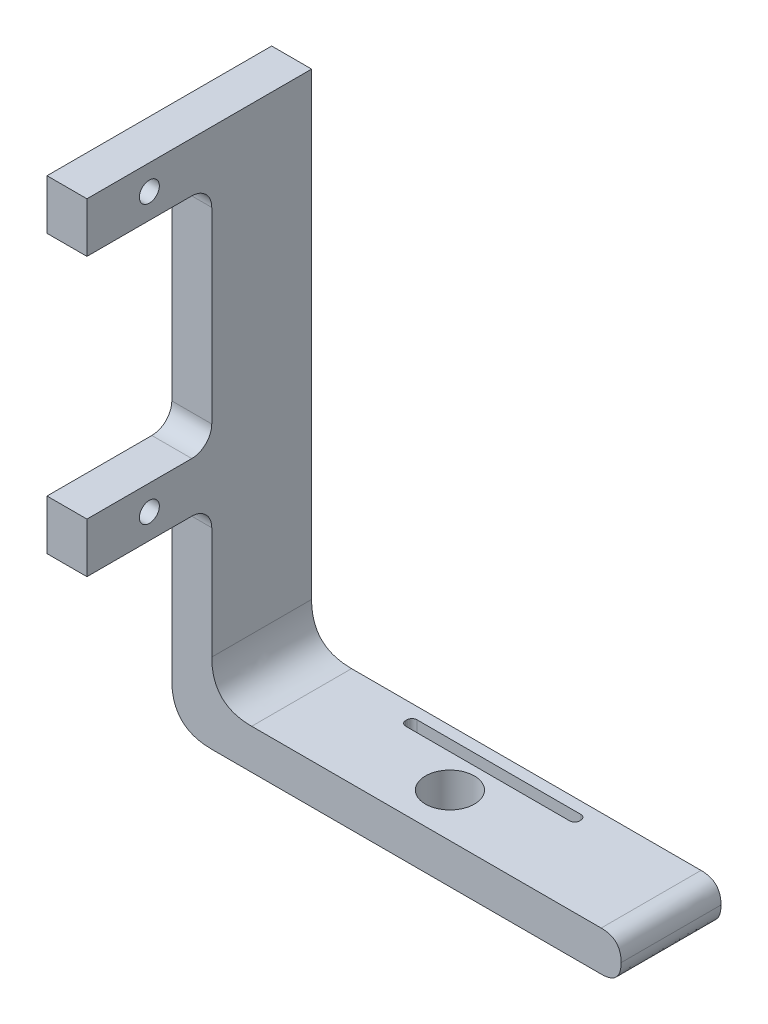
ISO-10303-21;
HEADER;
FILE_DESCRIPTION(('STEP AP214'),'2;1');
FILE_NAME('part.step','',(''),(''),'','','');
FILE_SCHEMA(('AUTOMOTIVE_DESIGN { 1 0 10303 214 1 1 1 1 }'));
ENDSEC;
DATA;
#1=APPLICATION_CONTEXT('core data for automotive mechanical design processes');
#2=APPLICATION_PROTOCOL_DEFINITION('international standard','automotive_design',2000,#1);
#3=PRODUCT_CONTEXT('',#1,'mechanical');
#4=PRODUCT('Part','Part','',(#3));
#5=PRODUCT_RELATED_PRODUCT_CATEGORY('part','',(#4));
#6=PRODUCT_DEFINITION_FORMATION('','',#4);
#7=PRODUCT_DEFINITION_CONTEXT('part definition',#1,'design');
#8=PRODUCT_DEFINITION('design','',#6,#7);
#9=PRODUCT_DEFINITION_SHAPE('','',#8);
#10=(LENGTH_UNIT() NAMED_UNIT(*) SI_UNIT(.MILLI.,.METRE.));
#11=(NAMED_UNIT(*) PLANE_ANGLE_UNIT() SI_UNIT($,.RADIAN.));
#12=(NAMED_UNIT(*) SI_UNIT($,.STERADIAN.) SOLID_ANGLE_UNIT());
#13=UNCERTAINTY_MEASURE_WITH_UNIT(LENGTH_MEASURE(1.E-05),#10,'distance_accuracy_value','');
#14=(GEOMETRIC_REPRESENTATION_CONTEXT(3) GLOBAL_UNCERTAINTY_ASSIGNED_CONTEXT((#13)) GLOBAL_UNIT_ASSIGNED_CONTEXT((#10,
#11,#12)) REPRESENTATION_CONTEXT('',''));
#15=CARTESIAN_POINT('',(0.,0.,0.));
#16=DIRECTION('',(0.,0.,1.));
#17=DIRECTION('',(1.,0.,0.));
#18=AXIS2_PLACEMENT_3D('',#15,#16,#17);
#19=CARTESIAN_POINT('',(15.7099054798782,0.,1.78356237533944));
#20=DIRECTION('',(0.,1.,0.));
#21=DIRECTION('',(0.,0.,1.));
#22=AXIS2_PLACEMENT_3D('',#19,#20,#21);
#23=CYLINDRICAL_SURFACE('',#22,0.5);
#24=DIRECTION('',(0.,-1.,0.));
#25=VECTOR('',#24,1.);
#26=CARTESIAN_POINT('',(15.2099054798782,0.,1.78356237533944));
#27=LINE('',#26,#25);
#28=CARTESIAN_POINT('',(15.2099054798782,4.,1.78356237533944));
#29=VERTEX_POINT('',#28);
#30=CARTESIAN_POINT('',(15.2099054798782,0.,1.78356237533944));
#31=VERTEX_POINT('',#30);
#32=EDGE_CURVE('E664',#29,#31,#27,.T.);
#33=ORIENTED_EDGE('',*,*,#32,.F.);
#34=CARTESIAN_POINT('',(15.7099054798782,4.,1.78356237533944));
#35=DIRECTION('',(0.,1.,0.));
#36=DIRECTION('',(0.,0.,1.));
#37=AXIS2_PLACEMENT_3D('',#34,#35,#36);
#38=CIRCLE('',#37,0.5);
#39=CARTESIAN_POINT('',(15.7099054798782,4.,2.28356237533944));
#40=VERTEX_POINT('',#39);
#41=EDGE_CURVE('E49',#29,#40,#38,.T.);
#42=ORIENTED_EDGE('',*,*,#41,.T.);
#43=DIRECTION('',(0.,-1.,0.));
#44=VECTOR('',#43,1.);
#45=CARTESIAN_POINT('',(15.7099054798782,0.,2.28356237533944));
#46=LINE('',#45,#44);
#47=CARTESIAN_POINT('',(15.7099054798782,0.,2.28356237533944));
#48=VERTEX_POINT('',#47);
#49=EDGE_CURVE('E668',#48,#40,#46,.F.);
#50=ORIENTED_EDGE('',*,*,#49,.F.);
#51=CARTESIAN_POINT('',(15.7099054798782,0.,1.78356237533944));
#52=DIRECTION('',(0.,1.,0.));
#53=DIRECTION('',(0.,0.,1.));
#54=AXIS2_PLACEMENT_3D('',#51,#52,#53);
#55=CIRCLE('',#54,0.5);
#56=EDGE_CURVE('E12',#48,#31,#55,.F.);
#57=ORIENTED_EDGE('',*,*,#56,.T.);
#58=EDGE_LOOP('',(#33,#42,#50,#57));
#59=FACE_BOUND('',#58,.T.);
#60=ADVANCED_FACE('F42',(#59),#23,.F.);
#61=CARTESIAN_POINT('',(15.7099054798782,0.,1.66052720971282));
#62=DIRECTION('',(0.,-1.,0.));
#63=DIRECTION('',(0.,0.,-1.));
#64=AXIS2_PLACEMENT_3D('',#61,#62,#63);
#65=CYLINDRICAL_SURFACE('',#64,0.5);
#66=DIRECTION('',(0.,-1.,0.));
#67=VECTOR('',#66,1.);
#68=CARTESIAN_POINT('',(15.7099054798782,0.,1.16052720971282));
#69=LINE('',#68,#67);
#70=CARTESIAN_POINT('',(15.7099054798782,4.,1.16052720971282));
#71=VERTEX_POINT('',#70);
#72=CARTESIAN_POINT('',(15.7099054798782,0.,1.16052720971282));
#73=VERTEX_POINT('',#72);
#74=EDGE_CURVE('E754',#71,#73,#69,.T.);
#75=ORIENTED_EDGE('',*,*,#74,.F.);
#76=CARTESIAN_POINT('',(15.7099054798782,4.,1.66052720971282));
#77=DIRECTION('',(0.,1.,0.));
#78=DIRECTION('',(0.,0.,1.));
#79=AXIS2_PLACEMENT_3D('',#76,#77,#78);
#80=CIRCLE('',#79,0.5);
#81=CARTESIAN_POINT('',(15.2099054798782,4.,1.66052720971282));
#82=VERTEX_POINT('',#81);
#83=EDGE_CURVE('E758',#71,#82,#80,.T.);
#84=ORIENTED_EDGE('',*,*,#83,.T.);
#85=DIRECTION('',(0.,-1.,0.));
#86=VECTOR('',#85,1.);
#87=CARTESIAN_POINT('',(15.2099054798782,0.,1.66052720971282));
#88=LINE('',#87,#86);
#89=CARTESIAN_POINT('',(15.2099054798782,0.,1.66052720971282));
#90=VERTEX_POINT('',#89);
#91=EDGE_CURVE('E676',#90,#82,#88,.F.);
#92=ORIENTED_EDGE('',*,*,#91,.F.);
#93=CARTESIAN_POINT('',(15.7099054798782,0.,1.66052720971282));
#94=DIRECTION('',(0.,1.,0.));
#95=DIRECTION('',(0.,0.,1.));
#96=AXIS2_PLACEMENT_3D('',#93,#94,#95);
#97=CIRCLE('',#96,0.5);
#98=EDGE_CURVE('E669',#90,#73,#97,.F.);
#99=ORIENTED_EDGE('',*,*,#98,.T.);
#100=EDGE_LOOP('',(#75,#84,#92,#99));
#101=FACE_BOUND('',#100,.T.);
#102=ADVANCED_FACE('F657',(#101),#65,.F.);
#103=CARTESIAN_POINT('',(32.1258703784816,0.,1.78356237533944));
#104=DIRECTION('',(0.,1.,0.));
#105=DIRECTION('',(0.,0.,1.));
#106=AXIS2_PLACEMENT_3D('',#103,#104,#105);
#107=CYLINDRICAL_SURFACE('',#106,0.5);
#108=DIRECTION('',(0.,1.,0.));
#109=VECTOR('',#108,1.);
#110=CARTESIAN_POINT('',(32.6258703784816,0.,1.78356237533944));
#111=LINE('',#110,#109);
#112=CARTESIAN_POINT('',(32.6258703784816,0.,1.78356237533944));
#113=VERTEX_POINT('',#112);
#114=CARTESIAN_POINT('',(32.6258703784816,4.,1.78356237533944));
#115=VERTEX_POINT('',#114);
#116=EDGE_CURVE('E743',#113,#115,#111,.T.);
#117=ORIENTED_EDGE('',*,*,#116,.F.);
#118=CARTESIAN_POINT('',(32.1258703784816,0.,1.78356237533944));
#119=DIRECTION('',(0.,1.,0.));
#120=DIRECTION('',(0.,0.,1.));
#121=AXIS2_PLACEMENT_3D('',#118,#119,#120);
#122=CIRCLE('',#121,0.5);
#123=CARTESIAN_POINT('',(32.1258703784816,0.,2.28356237533944));
#124=VERTEX_POINT('',#123);
#125=EDGE_CURVE('E749',#113,#124,#122,.F.);
#126=ORIENTED_EDGE('',*,*,#125,.T.);
#127=DIRECTION('',(0.,1.,0.));
#128=VECTOR('',#127,1.);
#129=CARTESIAN_POINT('',(32.1258703784816,0.,2.28356237533944));
#130=LINE('',#129,#128);
#131=CARTESIAN_POINT('',(32.1258703784816,4.,2.28356237533944));
#132=VERTEX_POINT('',#131);
#133=EDGE_CURVE('E746',#132,#124,#130,.F.);
#134=ORIENTED_EDGE('',*,*,#133,.F.);
#135=CARTESIAN_POINT('',(32.1258703784816,4.,1.78356237533944));
#136=DIRECTION('',(0.,1.,0.));
#137=DIRECTION('',(0.,0.,1.));
#138=AXIS2_PLACEMENT_3D('',#135,#136,#137);
#139=CIRCLE('',#138,0.5);
#140=EDGE_CURVE('E752',#132,#115,#139,.T.);
#141=ORIENTED_EDGE('',*,*,#140,.T.);
#142=EDGE_LOOP('',(#117,#126,#134,#141));
#143=FACE_BOUND('',#142,.T.);
#144=ADVANCED_FACE('F661',(#143),#107,.F.);
#145=CARTESIAN_POINT('',(32.1258703784816,0.,1.66052720971282));
#146=DIRECTION('',(0.,-1.,0.));
#147=DIRECTION('',(0.,0.,-1.));
#148=AXIS2_PLACEMENT_3D('',#145,#146,#147);
#149=CYLINDRICAL_SURFACE('',#148,0.5);
#150=DIRECTION('',(0.,1.,0.));
#151=VECTOR('',#150,1.);
#152=CARTESIAN_POINT('',(32.1258703784816,0.,1.16052720971282));
#153=LINE('',#152,#151);
#154=CARTESIAN_POINT('',(32.1258703784816,0.,1.16052720971282));
#155=VERTEX_POINT('',#154);
#156=CARTESIAN_POINT('',(32.1258703784816,4.,1.16052720971282));
#157=VERTEX_POINT('',#156);
#158=EDGE_CURVE('E732',#155,#157,#153,.T.);
#159=ORIENTED_EDGE('',*,*,#158,.F.);
#160=CARTESIAN_POINT('',(32.1258703784816,0.,1.66052720971282));
#161=DIRECTION('',(0.,1.,0.));
#162=DIRECTION('',(0.,0.,1.));
#163=AXIS2_PLACEMENT_3D('',#160,#161,#162);
#164=CIRCLE('',#163,0.5);
#165=CARTESIAN_POINT('',(32.6258703784816,0.,1.66052720971282));
#166=VERTEX_POINT('',#165);
#167=EDGE_CURVE('E738',#155,#166,#164,.F.);
#168=ORIENTED_EDGE('',*,*,#167,.T.);
#169=DIRECTION('',(0.,1.,0.));
#170=VECTOR('',#169,1.);
#171=CARTESIAN_POINT('',(32.6258703784816,0.,1.66052720971282));
#172=LINE('',#171,#170);
#173=CARTESIAN_POINT('',(32.6258703784816,4.,1.66052720971282));
#174=VERTEX_POINT('',#173);
#175=EDGE_CURVE('E735',#174,#166,#172,.F.);
#176=ORIENTED_EDGE('',*,*,#175,.F.);
#177=CARTESIAN_POINT('',(32.1258703784816,4.,1.66052720971282));
#178=DIRECTION('',(0.,1.,0.));
#179=DIRECTION('',(0.,0.,1.));
#180=AXIS2_PLACEMENT_3D('',#177,#178,#179);
#181=CIRCLE('',#180,0.5);
#182=EDGE_CURVE('E740',#174,#157,#181,.T.);
#183=ORIENTED_EDGE('',*,*,#182,.T.);
#184=EDGE_LOOP('',(#159,#168,#176,#183));
#185=FACE_BOUND('',#184,.T.);
#186=ADVANCED_FACE('F903',(#185),#149,.F.);
#187=CARTESIAN_POINT('',(0.,0.,10.));
#188=DIRECTION('',(0.,1.,0.));
#189=DIRECTION('',(0.,0.,1.));
#190=AXIS2_PLACEMENT_3D('',#187,#188,#189);
#191=PLANE('',#190);
#192=ORIENTED_EDGE('',*,*,#56,.F.);
#193=DIRECTION('',(1.,0.,0.));
#194=VECTOR('',#193,1.);
#195=CARTESIAN_POINT('',(15.2099054798782,0.,2.28356237533944));
#196=LINE('',#195,#194);
#197=EDGE_CURVE('E766',#48,#124,#196,.T.);
#198=ORIENTED_EDGE('',*,*,#197,.T.);
#199=ORIENTED_EDGE('',*,*,#125,.F.);
#200=DIRECTION('',(0.,0.,1.));
#201=VECTOR('',#200,1.);
#202=CARTESIAN_POINT('',(32.6258703784816,0.,1.16052720971282));
#203=LINE('',#202,#201);
#204=EDGE_CURVE('E680',#166,#113,#203,.T.);
#205=ORIENTED_EDGE('',*,*,#204,.F.);
#206=ORIENTED_EDGE('',*,*,#167,.F.);
#207=DIRECTION('',(1.,0.,0.));
#208=VECTOR('',#207,1.);
#209=CARTESIAN_POINT('',(15.2099054798782,0.,1.16052720971282));
#210=LINE('',#209,#208);
#211=EDGE_CURVE('E677',#73,#155,#210,.T.);
#212=ORIENTED_EDGE('',*,*,#211,.F.);
#213=ORIENTED_EDGE('',*,*,#98,.F.);
#214=DIRECTION('',(0.,0.,1.));
#215=VECTOR('',#214,1.);
#216=CARTESIAN_POINT('',(15.2099054798782,0.,1.16052720971282));
#217=LINE('',#216,#215);
#218=EDGE_CURVE('E695',#90,#31,#217,.T.);
#219=ORIENTED_EDGE('',*,*,#218,.T.);
#220=EDGE_LOOP('',(#192,#198,#199,#205,#206,#212,#213,#219));
#221=FACE_BOUND('',#220,.T.);
#222=CARTESIAN_POINT('',(23.4551751044432,0.,5.60271706286386));
#223=DIRECTION('',(0.,1.,0.));
#224=DIRECTION('',(0.,0.,1.));
#225=AXIS2_PLACEMENT_3D('',#222,#223,#224);
#226=CIRCLE('',#225,2.45);
#227=CARTESIAN_POINT('',(23.4551751044432,0.,8.05271706286386));
#228=VERTEX_POINT('',#227);
#229=EDGE_CURVE('E782',#228,#228,#226,.T.);
#230=ORIENTED_EDGE('',*,*,#229,.T.);
#231=EDGE_LOOP('',(#230));
#232=FACE_BOUND('',#231,.T.);
#233=DIRECTION('',(1.,0.,0.));
#234=VECTOR('',#233,1.);
#235=CARTESIAN_POINT('',(0.,0.,0.));
#236=LINE('',#235,#234);
#237=CARTESIAN_POINT('',(4.,0.,0.));
#238=VERTEX_POINT('',#237);
#239=CARTESIAN_POINT('',(43.,0.,0.));
#240=VERTEX_POINT('',#239);
#241=EDGE_CURVE('E286',#238,#240,#236,.T.);
#242=ORIENTED_EDGE('',*,*,#241,.T.);
#243=CARTESIAN_POINT('',(43.,0.,11.));
#244=CARTESIAN_POINT('',(43.,0.,7.));
#245=CARTESIAN_POINT('',(43.,0.,3.));
#246=CARTESIAN_POINT('',(43.,0.,-0.999999999999999));
#247=(BOUNDED_CURVE() B_SPLINE_CURVE(3,(#243,#244,#245,#246),.UNSPECIFIED.,.F.,
.F.) B_SPLINE_CURVE_WITH_KNOTS((4,4),(-0.001,0.011),
.UNSPECIFIED.) CURVE() GEOMETRIC_REPRESENTATION_ITEM() RATIONAL_B_SPLINE_CURVE((1.,1.,1.,1.)) REPRESENTATION_ITEM(''));
#248=CARTESIAN_POINT('',(43.,0.,10.));
#249=VERTEX_POINT('',#248);
#250=EDGE_CURVE('E450',#240,#249,#247,.F.);
#251=ORIENTED_EDGE('',*,*,#250,.T.);
#252=DIRECTION('',(1.,0.,0.));
#253=VECTOR('',#252,1.);
#254=CARTESIAN_POINT('',(0.,0.,10.));
#255=LINE('',#254,#253);
#256=CARTESIAN_POINT('',(4.,0.,10.));
#257=VERTEX_POINT('',#256);
#258=EDGE_CURVE('E272',#257,#249,#255,.T.);
#259=ORIENTED_EDGE('',*,*,#258,.F.);
#260=CARTESIAN_POINT('',(4.,0.,-0.999999999999999));
#261=CARTESIAN_POINT('',(4.,0.,3.));
#262=CARTESIAN_POINT('',(4.,0.,7.));
#263=CARTESIAN_POINT('',(4.,0.,11.));
#264=(BOUNDED_CURVE() B_SPLINE_CURVE(3,(#260,#261,#262,#263),.UNSPECIFIED.,.F.,
.F.) B_SPLINE_CURVE_WITH_KNOTS((4,4),(-0.001,0.011),
.UNSPECIFIED.) CURVE() GEOMETRIC_REPRESENTATION_ITEM() RATIONAL_B_SPLINE_CURVE((1.,1.,1.,1.)) REPRESENTATION_ITEM(''));
#265=EDGE_CURVE('E618',#257,#238,#264,.F.);
#266=ORIENTED_EDGE('',*,*,#265,.T.);
#267=EDGE_LOOP('',(#242,#251,#259,#266));
#268=FACE_BOUND('',#267,.T.);
#269=ADVANCED_FACE('F300',(#221,#232,#268),#191,.F.);
#270=CARTESIAN_POINT('',(0.,4.,10.));
#271=DIRECTION('',(0.,1.,0.));
#272=DIRECTION('',(0.,0.,1.));
#273=AXIS2_PLACEMENT_3D('',#270,#271,#272);
#274=PLANE('',#273);
#275=ORIENTED_EDGE('',*,*,#83,.F.);
#276=DIRECTION('',(1.,0.,0.));
#277=VECTOR('',#276,1.);
#278=CARTESIAN_POINT('',(15.2099054798782,4.,1.16052720971282));
#279=LINE('',#278,#277);
#280=EDGE_CURVE('E781',#71,#157,#279,.T.);
#281=ORIENTED_EDGE('',*,*,#280,.T.);
#282=ORIENTED_EDGE('',*,*,#182,.F.);
#283=DIRECTION('',(0.,0.,1.));
#284=VECTOR('',#283,1.);
#285=CARTESIAN_POINT('',(32.6258703784816,4.,1.16052720971282));
#286=LINE('',#285,#284);
#287=EDGE_CURVE('E682',#174,#115,#286,.T.);
#288=ORIENTED_EDGE('',*,*,#287,.T.);
#289=ORIENTED_EDGE('',*,*,#140,.F.);
#290=DIRECTION('',(1.,0.,0.));
#291=VECTOR('',#290,1.);
#292=CARTESIAN_POINT('',(15.2099054798782,4.,2.28356237533944));
#293=LINE('',#292,#291);
#294=EDGE_CURVE('E678',#40,#132,#293,.T.);
#295=ORIENTED_EDGE('',*,*,#294,.F.);
#296=ORIENTED_EDGE('',*,*,#41,.F.);
#297=DIRECTION('',(0.,0.,1.));
#298=VECTOR('',#297,1.);
#299=CARTESIAN_POINT('',(15.2099054798782,4.,1.16052720971282));
#300=LINE('',#299,#298);
#301=EDGE_CURVE('E673',#82,#29,#300,.T.);
#302=ORIENTED_EDGE('',*,*,#301,.F.);
#303=EDGE_LOOP('',(#275,#281,#282,#288,#289,#295,#296,#302));
#304=FACE_BOUND('',#303,.T.);
#305=CARTESIAN_POINT('',(23.4551751044432,4.,5.60271706286386));
#306=DIRECTION('',(0.,1.,0.));
#307=DIRECTION('',(0.,0.,1.));
#308=AXIS2_PLACEMENT_3D('',#305,#306,#307);
#309=CIRCLE('',#308,2.45);
#310=CARTESIAN_POINT('',(23.4551751044432,4.,8.05271706286386));
#311=VERTEX_POINT('',#310);
#312=EDGE_CURVE('E785',#311,#311,#309,.T.);
#313=ORIENTED_EDGE('',*,*,#312,.F.);
#314=EDGE_LOOP('',(#313));
#315=FACE_BOUND('',#314,.T.);
#316=DIRECTION('',(1.,0.,0.));
#317=VECTOR('',#316,1.);
#318=CARTESIAN_POINT('',(0.,4.,10.));
#319=LINE('',#318,#317);
#320=CARTESIAN_POINT('',(8.,4.,10.));
#321=VERTEX_POINT('',#320);
#322=CARTESIAN_POINT('',(43.,4.,10.));
#323=VERTEX_POINT('',#322);
#324=EDGE_CURVE('E531',#321,#323,#319,.T.);
#325=ORIENTED_EDGE('',*,*,#324,.T.);
#326=CARTESIAN_POINT('',(43.,4.,-0.999999999999999));
#327=CARTESIAN_POINT('',(43.,4.,3.));
#328=CARTESIAN_POINT('',(43.,4.,6.99999999999999));
#329=CARTESIAN_POINT('',(43.,4.,11.));
#330=(BOUNDED_CURVE() B_SPLINE_CURVE(3,(#326,#327,#328,#329),.UNSPECIFIED.,.F.,
.F.) B_SPLINE_CURVE_WITH_KNOTS((4,4),(-0.011,0.001),
.UNSPECIFIED.) CURVE() GEOMETRIC_REPRESENTATION_ITEM() RATIONAL_B_SPLINE_CURVE((1.,1.,1.,1.)) REPRESENTATION_ITEM(''));
#331=CARTESIAN_POINT('',(43.,4.,0.));
#332=VERTEX_POINT('',#331);
#333=EDGE_CURVE('E520',#323,#332,#330,.F.);
#334=ORIENTED_EDGE('',*,*,#333,.T.);
#335=DIRECTION('',(1.,0.,0.));
#336=VECTOR('',#335,1.);
#337=CARTESIAN_POINT('',(0.,4.,0.));
#338=LINE('',#337,#336);
#339=CARTESIAN_POINT('',(8.,4.,0.));
#340=VERTEX_POINT('',#339);
#341=EDGE_CURVE('E541',#340,#332,#338,.T.);
#342=ORIENTED_EDGE('',*,*,#341,.F.);
#343=CARTESIAN_POINT('',(8.,4.,11.));
#344=CARTESIAN_POINT('',(8.,4.,6.99999999999999));
#345=CARTESIAN_POINT('',(8.,4.,3.));
#346=CARTESIAN_POINT('',(8.,4.,-0.999999999999999));
#347=(BOUNDED_CURVE() B_SPLINE_CURVE(3,(#343,#344,#345,#346),.UNSPECIFIED.,.F.,
.F.) B_SPLINE_CURVE_WITH_KNOTS((4,4),(-0.011,0.001),
.UNSPECIFIED.) CURVE() GEOMETRIC_REPRESENTATION_ITEM() RATIONAL_B_SPLINE_CURVE((1.,1.,1.,1.)) REPRESENTATION_ITEM(''));
#348=EDGE_CURVE('E534',#340,#321,#347,.F.);
#349=ORIENTED_EDGE('',*,*,#348,.T.);
#350=EDGE_LOOP('',(#325,#334,#342,#349));
#351=FACE_BOUND('',#350,.T.);
#352=ADVANCED_FACE('F532',(#304,#315,#351),#274,.T.);
#353=CARTESIAN_POINT('',(0.,28.22,12.));
#354=DIRECTION('',(1.,0.,0.));
#355=DIRECTION('',(0.,0.,-1.));
#356=AXIS2_PLACEMENT_3D('',#353,#354,#355);
#357=CYLINDRICAL_SURFACE('',#356,2.);
#358=DIRECTION('',(1.,0.,0.));
#359=VECTOR('',#358,1.);
#360=CARTESIAN_POINT('',(0.,28.22,10.));
#361=LINE('',#360,#359);
#362=CARTESIAN_POINT('',(0.,28.22,10.));
#363=VERTEX_POINT('',#362);
#364=CARTESIAN_POINT('',(4.,28.22,10.));
#365=VERTEX_POINT('',#364);
#366=EDGE_CURVE('E724',#363,#365,#361,.T.);
#367=ORIENTED_EDGE('',*,*,#366,.F.);
#368=CARTESIAN_POINT('',(0.,28.22,12.));
#369=DIRECTION('',(-1.,0.,0.));
#370=DIRECTION('',(0.,0.,1.));
#371=AXIS2_PLACEMENT_3D('',#368,#369,#370);
#372=CIRCLE('',#371,2.);
#373=CARTESIAN_POINT('',(0.,26.22,12.));
#374=VERTEX_POINT('',#373);
#375=EDGE_CURVE('E729',#363,#374,#372,.T.);
#376=ORIENTED_EDGE('',*,*,#375,.T.);
#377=DIRECTION('',(1.,0.,0.));
#378=VECTOR('',#377,1.);
#379=CARTESIAN_POINT('',(4.,26.22,12.));
#380=LINE('',#379,#378);
#381=CARTESIAN_POINT('',(4.,26.22,12.));
#382=VERTEX_POINT('',#381);
#383=EDGE_CURVE('E727',#382,#374,#380,.F.);
#384=ORIENTED_EDGE('',*,*,#383,.F.);
#385=CARTESIAN_POINT('',(4.,28.22,12.));
#386=DIRECTION('',(-1.,0.,0.));
#387=DIRECTION('',(0.,0.,1.));
#388=AXIS2_PLACEMENT_3D('',#385,#386,#387);
#389=CIRCLE('',#388,2.);
#390=EDGE_CURVE('E236',#382,#365,#389,.F.);
#391=ORIENTED_EDGE('',*,*,#390,.T.);
#392=EDGE_LOOP('',(#367,#376,#384,#391));
#393=FACE_BOUND('',#392,.T.);
#394=ADVANCED_FACE('F574',(#393),#357,.F.);
#395=CARTESIAN_POINT('',(4.,19.22,12.));
#396=DIRECTION('',(1.,0.,0.));
#397=DIRECTION('',(0.,0.,-1.));
#398=AXIS2_PLACEMENT_3D('',#395,#396,#397);
#399=CYLINDRICAL_SURFACE('',#398,2.);
#400=DIRECTION('',(1.,0.,0.));
#401=VECTOR('',#400,1.);
#402=CARTESIAN_POINT('',(4.,21.22,12.));
#403=LINE('',#402,#401);
#404=CARTESIAN_POINT('',(0.,21.22,12.));
#405=VERTEX_POINT('',#404);
#406=CARTESIAN_POINT('',(4.,21.22,12.));
#407=VERTEX_POINT('',#406);
#408=EDGE_CURVE('E707',#405,#407,#403,.T.);
#409=ORIENTED_EDGE('',*,*,#408,.F.);
#410=CARTESIAN_POINT('',(0.,19.22,12.));
#411=DIRECTION('',(-1.,0.,0.));
#412=DIRECTION('',(0.,0.,1.));
#413=AXIS2_PLACEMENT_3D('',#410,#411,#412);
#414=CIRCLE('',#413,2.);
#415=CARTESIAN_POINT('',(0.,19.22,10.));
#416=VERTEX_POINT('',#415);
#417=EDGE_CURVE('E708',#405,#416,#414,.T.);
#418=ORIENTED_EDGE('',*,*,#417,.T.);
#419=DIRECTION('',(1.,0.,0.));
#420=VECTOR('',#419,1.);
#421=CARTESIAN_POINT('',(0.,19.22,10.));
#422=LINE('',#421,#420);
#423=CARTESIAN_POINT('',(4.,19.22,10.));
#424=VERTEX_POINT('',#423);
#425=EDGE_CURVE('E713',#424,#416,#422,.F.);
#426=ORIENTED_EDGE('',*,*,#425,.F.);
#427=CARTESIAN_POINT('',(4.,19.22,12.));
#428=DIRECTION('',(-1.,0.,0.));
#429=DIRECTION('',(0.,0.,1.));
#430=AXIS2_PLACEMENT_3D('',#427,#428,#429);
#431=CIRCLE('',#430,2.);
#432=EDGE_CURVE('E712',#424,#407,#431,.F.);
#433=ORIENTED_EDGE('',*,*,#432,.T.);
#434=EDGE_LOOP('',(#409,#418,#426,#433));
#435=FACE_BOUND('',#434,.T.);
#436=ADVANCED_FACE('F715',(#435),#399,.F.);
#437=CARTESIAN_POINT('',(0.,47.,12.));
#438=DIRECTION('',(1.,0.,0.));
#439=DIRECTION('',(0.,0.,-1.));
#440=AXIS2_PLACEMENT_3D('',#437,#438,#439);
#441=CYLINDRICAL_SURFACE('',#440,2.);
#442=DIRECTION('',(1.,0.,0.));
#443=VECTOR('',#442,1.);
#444=CARTESIAN_POINT('',(0.,49.,12.));
#445=LINE('',#444,#443);
#446=CARTESIAN_POINT('',(0.,49.,12.));
#447=VERTEX_POINT('',#446);
#448=CARTESIAN_POINT('',(4.,49.,12.));
#449=VERTEX_POINT('',#448);
#450=EDGE_CURVE('E833',#447,#449,#445,.T.);
#451=ORIENTED_EDGE('',*,*,#450,.F.);
#452=CARTESIAN_POINT('',(0.,47.,12.));
#453=DIRECTION('',(-1.,0.,0.));
#454=DIRECTION('',(0.,0.,1.));
#455=AXIS2_PLACEMENT_3D('',#452,#453,#454);
#456=CIRCLE('',#455,2.);
#457=CARTESIAN_POINT('',(0.,47.,10.));
#458=VERTEX_POINT('',#457);
#459=EDGE_CURVE('E719',#447,#458,#456,.T.);
#460=ORIENTED_EDGE('',*,*,#459,.T.);
#461=DIRECTION('',(1.,0.,0.));
#462=VECTOR('',#461,1.);
#463=CARTESIAN_POINT('',(0.,47.,10.));
#464=LINE('',#463,#462);
#465=CARTESIAN_POINT('',(4.,47.,10.));
#466=VERTEX_POINT('',#465);
#467=EDGE_CURVE('E839',#466,#458,#464,.F.);
#468=ORIENTED_EDGE('',*,*,#467,.F.);
#469=CARTESIAN_POINT('',(4.,47.,12.));
#470=DIRECTION('',(-1.,0.,0.));
#471=DIRECTION('',(0.,0.,1.));
#472=AXIS2_PLACEMENT_3D('',#469,#470,#471);
#473=CIRCLE('',#472,2.);
#474=EDGE_CURVE('E716',#466,#449,#473,.F.);
#475=ORIENTED_EDGE('',*,*,#474,.T.);
#476=EDGE_LOOP('',(#451,#460,#468,#475));
#477=FACE_BOUND('',#476,.T.);
#478=ADVANCED_FACE('F840',(#477),#441,.F.);
#479=CARTESIAN_POINT('',(45.,2.,11.));
#480=CARTESIAN_POINT('',(45.,2.,7.));
#481=CARTESIAN_POINT('',(45.,2.,3.));
#482=CARTESIAN_POINT('',(45.,2.,-0.999999999999999));
#483=CARTESIAN_POINT('',(45.,0.,11.));
#484=CARTESIAN_POINT('',(45.,0.,7.));
#485=CARTESIAN_POINT('',(45.,0.,2.99999999999999));
#486=CARTESIAN_POINT('',(45.,0.,-0.999999999999999));
#487=CARTESIAN_POINT('',(43.,0.,11.));
#488=CARTESIAN_POINT('',(43.,0.,7.));
#489=CARTESIAN_POINT('',(43.,0.,3.));
#490=CARTESIAN_POINT('',(43.,0.,-0.999999999999999));
#491=(BOUNDED_SURFACE() B_SPLINE_SURFACE(2,3,((#479,#480,#481,#482),(#483,#484,#485,#486),(#487,
#488,#489,#490)),.UNSPECIFIED.,.F.,.F.,.F.) B_SPLINE_SURFACE_WITH_KNOTS((3,3),(4,4),(0.,1.),
(-0.001,0.011),.UNSPECIFIED.) GEOMETRIC_REPRESENTATION_ITEM() RATIONAL_B_SPLINE_SURFACE(((1.,1.,
1.,1.),(1.,1.,1.,1.),(1.,1.,1.,1.))) REPRESENTATION_ITEM('') SURFACE());
#492=CARTESIAN_POINT('',(45.,2.,-0.999999999999999));
#493=CARTESIAN_POINT('',(45.,2.,3.));
#494=CARTESIAN_POINT('',(45.,2.,7.));
#495=CARTESIAN_POINT('',(45.,2.,11.));
#496=(BOUNDED_CURVE() B_SPLINE_CURVE(3,(#492,#493,#494,#495),.UNSPECIFIED.,.F.,
.F.) B_SPLINE_CURVE_WITH_KNOTS((4,4),(-0.001,0.011),
.UNSPECIFIED.) CURVE() GEOMETRIC_REPRESENTATION_ITEM() RATIONAL_B_SPLINE_CURVE((1.,1.,1.,1.)) REPRESENTATION_ITEM(''));
#497=CARTESIAN_POINT('',(45.,2.,0.));
#498=VERTEX_POINT('',#497);
#499=CARTESIAN_POINT('',(45.,2.,10.));
#500=VERTEX_POINT('',#499);
#501=EDGE_CURVE('E527',#498,#500,#496,.T.);
#502=CARTESIAN_POINT('',(45.,2.,10.));
#503=CARTESIAN_POINT('',(45.,0.,10.));
#504=CARTESIAN_POINT('',(43.,0.,10.));
#505=(BOUNDED_CURVE() B_SPLINE_CURVE(2,(#502,#503,#504),.UNSPECIFIED.,.F.,
.F.) B_SPLINE_CURVE_WITH_KNOTS((3,3),(0.,1.),
.UNSPECIFIED.) CURVE() GEOMETRIC_REPRESENTATION_ITEM() RATIONAL_B_SPLINE_CURVE((1.,1.,1.)) REPRESENTATION_ITEM(''));
#506=EDGE_CURVE('E462',#249,#500,#505,.F.);
#507=CARTESIAN_POINT('',(43.,0.,0.));
#508=CARTESIAN_POINT('',(45.,0.,0.));
#509=CARTESIAN_POINT('',(45.,2.,0.));
#510=(BOUNDED_CURVE() B_SPLINE_CURVE(2,(#507,#508,#509),.UNSPECIFIED.,.F.,
.F.) B_SPLINE_CURVE_WITH_KNOTS((3,3),(0.,1.),
.UNSPECIFIED.) CURVE() GEOMETRIC_REPRESENTATION_ITEM() RATIONAL_B_SPLINE_CURVE((1.,1.,1.)) REPRESENTATION_ITEM(''));
#511=EDGE_CURVE('E843',#498,#240,#510,.F.);
#512=ORIENTED_EDGE('',*,*,#501,.T.);
#513=ORIENTED_EDGE('',*,*,#506,.F.);
#514=ORIENTED_EDGE('',*,*,#250,.F.);
#515=ORIENTED_EDGE('',*,*,#511,.F.);
#516=EDGE_LOOP('',(#512,#513,#514,#515));
#517=FACE_BOUND('',#516,.T.);
#518=ADVANCED_FACE('F405',(#517),#491,.T.);
#519=CARTESIAN_POINT('',(45.,2.,-0.999999999999999));
#520=CARTESIAN_POINT('',(45.,2.,3.));
#521=CARTESIAN_POINT('',(45.,2.,6.99999999999999));
#522=CARTESIAN_POINT('',(45.,2.,11.));
#523=CARTESIAN_POINT('',(45.,4.00000000000001,-0.999999999999999));
#524=CARTESIAN_POINT('',(45.,4.00000000000001,3.));
#525=CARTESIAN_POINT('',(45.,4.00000000000001,7.));
#526=CARTESIAN_POINT('',(45.,4.00000000000001,11.));
#527=CARTESIAN_POINT('',(43.,4.,-0.999999999999999));
#528=CARTESIAN_POINT('',(43.,4.,3.));
#529=CARTESIAN_POINT('',(43.,4.,6.99999999999999));
#530=CARTESIAN_POINT('',(43.,4.,11.));
#531=(BOUNDED_SURFACE() B_SPLINE_SURFACE(2,3,((#519,#520,#521,#522),(#523,#524,#525,#526),(#527,
#528,#529,#530)),.UNSPECIFIED.,.F.,.F.,.F.) B_SPLINE_SURFACE_WITH_KNOTS((3,3),(4,4),(0.,1.),
(-0.011,0.001),.UNSPECIFIED.) GEOMETRIC_REPRESENTATION_ITEM() RATIONAL_B_SPLINE_SURFACE(((1.,1.,
1.,1.),(1.,1.,1.,1.),(1.,1.,1.,1.))) REPRESENTATION_ITEM('') SURFACE());
#532=CARTESIAN_POINT('',(43.,4.,10.));
#533=CARTESIAN_POINT('',(45.,4.00000000000001,10.));
#534=CARTESIAN_POINT('',(45.,2.,10.));
#535=(BOUNDED_CURVE() B_SPLINE_CURVE(2,(#532,#533,#534),.UNSPECIFIED.,.F.,
.F.) B_SPLINE_CURVE_WITH_KNOTS((3,3),(0.,1.),
.UNSPECIFIED.) CURVE() GEOMETRIC_REPRESENTATION_ITEM() RATIONAL_B_SPLINE_CURVE((1.,1.,1.)) REPRESENTATION_ITEM(''));
#536=EDGE_CURVE('E522',#500,#323,#535,.F.);
#537=CARTESIAN_POINT('',(45.,2.,0.));
#538=CARTESIAN_POINT('',(45.,4.00000000000001,0.));
#539=CARTESIAN_POINT('',(43.,4.,0.));
#540=(BOUNDED_CURVE() B_SPLINE_CURVE(2,(#537,#538,#539),.UNSPECIFIED.,.F.,
.F.) B_SPLINE_CURVE_WITH_KNOTS((3,3),(0.,1.),
.UNSPECIFIED.) CURVE() GEOMETRIC_REPRESENTATION_ITEM() RATIONAL_B_SPLINE_CURVE((1.,1.,1.)) REPRESENTATION_ITEM(''));
#541=EDGE_CURVE('E509',#332,#498,#540,.F.);
#542=ORIENTED_EDGE('',*,*,#333,.F.);
#543=ORIENTED_EDGE('',*,*,#536,.F.);
#544=ORIENTED_EDGE('',*,*,#501,.F.);
#545=ORIENTED_EDGE('',*,*,#541,.F.);
#546=EDGE_LOOP('',(#542,#543,#544,#545));
#547=FACE_BOUND('',#546,.T.);
#548=ADVANCED_FACE('F392',(#547),#531,.T.);
#549=CARTESIAN_POINT('',(4.,0.,11.));
#550=CARTESIAN_POINT('',(4.,0.,7.));
#551=CARTESIAN_POINT('',(4.,0.,3.));
#552=CARTESIAN_POINT('',(4.,0.,-0.999999999999999));
#553=CARTESIAN_POINT('',(0.,0.,11.));
#554=CARTESIAN_POINT('',(0.,0.,7.));
#555=CARTESIAN_POINT('',(0.,0.,2.99999999999999));
#556=CARTESIAN_POINT('',(0.,0.,-0.999999999999999));
#557=CARTESIAN_POINT('',(0.,4.,11.));
#558=CARTESIAN_POINT('',(0.,4.,7.));
#559=CARTESIAN_POINT('',(0.,4.,3.));
#560=CARTESIAN_POINT('',(0.,4.,-0.999999999999999));
#561=(BOUNDED_SURFACE() B_SPLINE_SURFACE(2,3,((#549,#550,#551,#552),(#553,#554,#555,#556),(#557,
#558,#559,#560)),.UNSPECIFIED.,.F.,.F.,.F.) B_SPLINE_SURFACE_WITH_KNOTS((3,3),(4,4),(0.,1.),
(-0.001,0.011),.UNSPECIFIED.) GEOMETRIC_REPRESENTATION_ITEM() RATIONAL_B_SPLINE_SURFACE(((1.,1.,
1.,1.),(1.,1.,1.,1.),(1.,1.,1.,1.))) REPRESENTATION_ITEM('') SURFACE());
#562=CARTESIAN_POINT('',(0.,4.,11.));
#563=CARTESIAN_POINT('',(0.,4.,7.));
#564=CARTESIAN_POINT('',(0.,4.,3.));
#565=CARTESIAN_POINT('',(0.,4.,-0.999999999999999));
#566=(BOUNDED_CURVE() B_SPLINE_CURVE(3,(#562,#563,#564,#565),.UNSPECIFIED.,.F.,
.F.) B_SPLINE_CURVE_WITH_KNOTS((4,4),(-0.001,0.011),
.UNSPECIFIED.) CURVE() GEOMETRIC_REPRESENTATION_ITEM() RATIONAL_B_SPLINE_CURVE((1.,1.,1.,1.)) REPRESENTATION_ITEM(''));
#567=CARTESIAN_POINT('',(0.,4.,0.));
#568=VERTEX_POINT('',#567);
#569=CARTESIAN_POINT('',(0.,4.,10.));
#570=VERTEX_POINT('',#569);
#571=EDGE_CURVE('E280',#568,#570,#566,.F.);
#572=CARTESIAN_POINT('',(0.,4.,0.));
#573=CARTESIAN_POINT('',(0.,0.,0.));
#574=CARTESIAN_POINT('',(4.,0.,0.));
#575=(BOUNDED_CURVE() B_SPLINE_CURVE(2,(#572,#573,#574),.UNSPECIFIED.,.F.,
.F.) B_SPLINE_CURVE_WITH_KNOTS((3,3),(0.,1.),
.UNSPECIFIED.) CURVE() GEOMETRIC_REPRESENTATION_ITEM() RATIONAL_B_SPLINE_CURVE((1.,1.,1.)) REPRESENTATION_ITEM(''));
#576=EDGE_CURVE('E607',#238,#568,#575,.F.);
#577=CARTESIAN_POINT('',(4.,0.,10.));
#578=CARTESIAN_POINT('',(0.,0.,10.));
#579=CARTESIAN_POINT('',(0.,4.,10.));
#580=(BOUNDED_CURVE() B_SPLINE_CURVE(2,(#577,#578,#579),.UNSPECIFIED.,.F.,
.F.) B_SPLINE_CURVE_WITH_KNOTS((3,3),(0.,1.),
.UNSPECIFIED.) CURVE() GEOMETRIC_REPRESENTATION_ITEM() RATIONAL_B_SPLINE_CURVE((1.,1.,1.)) REPRESENTATION_ITEM(''));
#581=EDGE_CURVE('E528',#570,#257,#580,.F.);
#582=ORIENTED_EDGE('',*,*,#571,.F.);
#583=ORIENTED_EDGE('',*,*,#576,.F.);
#584=ORIENTED_EDGE('',*,*,#265,.F.);
#585=ORIENTED_EDGE('',*,*,#581,.F.);
#586=EDGE_LOOP('',(#582,#583,#584,#585));
#587=FACE_BOUND('',#586,.T.);
#588=ADVANCED_FACE('F314',(#587),#561,.T.);
#589=CARTESIAN_POINT('',(8.,4.,-0.999999999999999));
#590=CARTESIAN_POINT('',(8.,4.,3.));
#591=CARTESIAN_POINT('',(8.,4.,6.99999999999999));
#592=CARTESIAN_POINT('',(8.,4.,11.));
#593=CARTESIAN_POINT('',(4.,4.,-0.999999999999999));
#594=CARTESIAN_POINT('',(4.,4.,3.));
#595=CARTESIAN_POINT('',(4.,4.,7.));
#596=CARTESIAN_POINT('',(4.,4.,11.));
#597=CARTESIAN_POINT('',(4.,8.,-0.999999999999999));
#598=CARTESIAN_POINT('',(4.,8.,3.));
#599=CARTESIAN_POINT('',(4.,8.,6.99999999999999));
#600=CARTESIAN_POINT('',(4.,8.,11.));
#601=(BOUNDED_SURFACE() B_SPLINE_SURFACE(2,3,((#589,#590,#591,#592),(#593,#594,#595,#596),(#597,
#598,#599,#600)),.UNSPECIFIED.,.F.,.F.,.F.) B_SPLINE_SURFACE_WITH_KNOTS((3,3),(4,4),(0.,1.),
(-0.011,0.001),.UNSPECIFIED.) GEOMETRIC_REPRESENTATION_ITEM() RATIONAL_B_SPLINE_SURFACE(((1.,1.,
1.,1.),(1.,1.,1.,1.),(1.,1.,1.,1.))) REPRESENTATION_ITEM('') SURFACE());
#602=CARTESIAN_POINT('',(8.,4.,0.));
#603=CARTESIAN_POINT('',(4.,4.,0.));
#604=CARTESIAN_POINT('',(4.,8.,0.));
#605=(BOUNDED_CURVE() B_SPLINE_CURVE(2,(#602,#603,#604),.UNSPECIFIED.,.F.,
.F.) B_SPLINE_CURVE_WITH_KNOTS((3,3),(0.,1.),
.UNSPECIFIED.) CURVE() GEOMETRIC_REPRESENTATION_ITEM() RATIONAL_B_SPLINE_CURVE((1.,1.,1.)) REPRESENTATION_ITEM(''));
#606=CARTESIAN_POINT('',(4.,8.,0.));
#607=VERTEX_POINT('',#606);
#608=EDGE_CURVE('E640',#340,#607,#605,.T.);
#609=CARTESIAN_POINT('',(4.,8.,-0.999999999999999));
#610=CARTESIAN_POINT('',(4.,8.,3.));
#611=CARTESIAN_POINT('',(4.,8.,6.99999999999999));
#612=CARTESIAN_POINT('',(4.,8.,11.));
#613=(BOUNDED_CURVE() B_SPLINE_CURVE(3,(#609,#610,#611,#612),.UNSPECIFIED.,.F.,
.F.) B_SPLINE_CURVE_WITH_KNOTS((4,4),(-0.011,0.001),
.UNSPECIFIED.) CURVE() GEOMETRIC_REPRESENTATION_ITEM() RATIONAL_B_SPLINE_CURVE((1.,1.,1.,1.)) REPRESENTATION_ITEM(''));
#614=CARTESIAN_POINT('',(4.,8.,10.));
#615=VERTEX_POINT('',#614);
#616=EDGE_CURVE('E558',#615,#607,#613,.F.);
#617=CARTESIAN_POINT('',(4.,8.,10.));
#618=CARTESIAN_POINT('',(4.,4.,10.));
#619=CARTESIAN_POINT('',(8.,4.,10.));
#620=(BOUNDED_CURVE() B_SPLINE_CURVE(2,(#617,#618,#619),.UNSPECIFIED.,.F.,
.F.) B_SPLINE_CURVE_WITH_KNOTS((3,3),(0.,1.),
.UNSPECIFIED.) CURVE() GEOMETRIC_REPRESENTATION_ITEM() RATIONAL_B_SPLINE_CURVE((1.,1.,1.)) REPRESENTATION_ITEM(''));
#621=EDGE_CURVE('E626',#615,#321,#620,.T.);
#622=ORIENTED_EDGE('',*,*,#348,.F.);
#623=ORIENTED_EDGE('',*,*,#608,.T.);
#624=ORIENTED_EDGE('',*,*,#616,.F.);
#625=ORIENTED_EDGE('',*,*,#621,.T.);
#626=EDGE_LOOP('',(#622,#623,#624,#625));
#627=FACE_BOUND('',#626,.T.);
#628=ADVANCED_FACE('F304',(#627),#601,.T.);
#629=CARTESIAN_POINT('',(0.,0.,10.));
#630=DIRECTION('',(0.,0.,1.));
#631=DIRECTION('',(1.,0.,0.));
#632=AXIS2_PLACEMENT_3D('',#629,#630,#631);
#633=PLANE('',#632);
#634=DIRECTION('',(0.,1.,0.));
#635=VECTOR('',#634,1.);
#636=CARTESIAN_POINT('',(0.,0.,10.));
#637=LINE('',#636,#635);
#638=EDGE_CURVE('E261',#363,#458,#637,.T.);
#639=ORIENTED_EDGE('',*,*,#638,.F.);
#640=ORIENTED_EDGE('',*,*,#366,.T.);
#641=DIRECTION('',(0.,1.,0.));
#642=VECTOR('',#641,1.);
#643=CARTESIAN_POINT('',(4.,0.,10.));
#644=LINE('',#643,#642);
#645=EDGE_CURVE('E536',#365,#466,#644,.T.);
#646=ORIENTED_EDGE('',*,*,#645,.T.);
#647=ORIENTED_EDGE('',*,*,#467,.T.);
#648=EDGE_LOOP('',(#639,#640,#646,#647));
#649=FACE_BOUND('',#648,.T.);
#650=ADVANCED_FACE('F313',(#649),#633,.T.);
#651=EDGE_CURVE('E538',#615,#424,#644,.T.);
#652=ORIENTED_EDGE('',*,*,#651,.T.);
#653=ORIENTED_EDGE('',*,*,#425,.T.);
#654=EDGE_CURVE('E264',#570,#416,#637,.T.);
#655=ORIENTED_EDGE('',*,*,#654,.F.);
#656=ORIENTED_EDGE('',*,*,#581,.T.);
#657=ORIENTED_EDGE('',*,*,#258,.T.);
#658=ORIENTED_EDGE('',*,*,#506,.T.);
#659=ORIENTED_EDGE('',*,*,#536,.T.);
#660=ORIENTED_EDGE('',*,*,#324,.F.);
#661=ORIENTED_EDGE('',*,*,#621,.F.);
#662=EDGE_LOOP('',(#652,#653,#655,#656,#657,#658,#659,#660,#661));
#663=FACE_BOUND('',#662,.T.);
#664=ADVANCED_FACE('F299',(#663),#633,.T.);
#665=CARTESIAN_POINT('',(0.,0.,10.));
#666=DIRECTION('',(-1.,0.,0.));
#667=DIRECTION('',(0.,0.,1.));
#668=AXIS2_PLACEMENT_3D('',#665,#666,#667);
#669=PLANE('',#668);
#670=ORIENTED_EDGE('',*,*,#375,.F.);
#671=ORIENTED_EDGE('',*,*,#638,.T.);
#672=ORIENTED_EDGE('',*,*,#459,.F.);
#673=DIRECTION('',(0.,0.,-1.));
#674=VECTOR('',#673,1.);
#675=CARTESIAN_POINT('',(0.,49.,22.5));
#676=LINE('',#675,#674);
#677=CARTESIAN_POINT('',(0.,49.,22.5));
#678=VERTEX_POINT('',#677);
#679=EDGE_CURVE('E257',#678,#447,#676,.T.);
#680=ORIENTED_EDGE('',*,*,#679,.F.);
#681=DIRECTION('',(0.,-1.,0.));
#682=VECTOR('',#681,1.);
#683=CARTESIAN_POINT('',(0.,54.,22.5));
#684=LINE('',#683,#682);
#685=CARTESIAN_POINT('',(0.,54.,22.5));
#686=VERTEX_POINT('',#685);
#687=EDGE_CURVE('E238',#686,#678,#684,.T.);
#688=ORIENTED_EDGE('',*,*,#687,.F.);
#689=DIRECTION('',(0.,0.,-1.));
#690=VECTOR('',#689,1.);
#691=CARTESIAN_POINT('',(0.,54.,10.));
#692=LINE('',#691,#690);
#693=CARTESIAN_POINT('',(0.,54.,0.));
#694=VERTEX_POINT('',#693);
#695=EDGE_CURVE('E552',#686,#694,#692,.T.);
#696=ORIENTED_EDGE('',*,*,#695,.T.);
#697=DIRECTION('',(0.,1.,0.));
#698=VECTOR('',#697,1.);
#699=CARTESIAN_POINT('',(0.,0.,0.));
#700=LINE('',#699,#698);
#701=EDGE_CURVE('E260',#568,#694,#700,.T.);
#702=ORIENTED_EDGE('',*,*,#701,.F.);
#703=ORIENTED_EDGE('',*,*,#571,.T.);
#704=ORIENTED_EDGE('',*,*,#654,.T.);
#705=ORIENTED_EDGE('',*,*,#417,.F.);
#706=DIRECTION('',(0.,0.,-1.));
#707=VECTOR('',#706,1.);
#708=CARTESIAN_POINT('',(0.,21.22,22.5));
#709=LINE('',#708,#707);
#710=CARTESIAN_POINT('',(0.,21.22,22.5));
#711=VERTEX_POINT('',#710);
#712=EDGE_CURVE('E243',#711,#405,#709,.T.);
#713=ORIENTED_EDGE('',*,*,#712,.F.);
#714=DIRECTION('',(0.,-1.,0.));
#715=VECTOR('',#714,1.);
#716=CARTESIAN_POINT('',(0.,21.22,22.5));
#717=LINE('',#716,#715);
#718=CARTESIAN_POINT('',(0.,26.22,22.5));
#719=VERTEX_POINT('',#718);
#720=EDGE_CURVE('E221',#719,#711,#717,.T.);
#721=ORIENTED_EDGE('',*,*,#720,.F.);
#722=DIRECTION('',(0.,0.,-1.));
#723=VECTOR('',#722,1.);
#724=CARTESIAN_POINT('',(0.,26.22,22.5));
#725=LINE('',#724,#723);
#726=EDGE_CURVE('E218',#719,#374,#725,.T.);
#727=ORIENTED_EDGE('',*,*,#726,.T.);
#728=EDGE_LOOP('',(#670,#671,#672,#680,#688,#696,#702,#703,#704,#705,#713,#721,#727));
#729=FACE_BOUND('',#728,.T.);
#730=CARTESIAN_POINT('',(0.,51.5,16.25));
#731=DIRECTION('',(-1.,0.,0.));
#732=DIRECTION('',(0.,0.,1.));
#733=AXIS2_PLACEMENT_3D('',#730,#731,#732);
#734=CIRCLE('',#733,1.);
#735=CARTESIAN_POINT('',(0.,51.5,17.25));
#736=VERTEX_POINT('',#735);
#737=EDGE_CURVE('E231',#736,#736,#734,.F.);
#738=ORIENTED_EDGE('',*,*,#737,.T.);
#739=EDGE_LOOP('',(#738));
#740=FACE_BOUND('',#739,.T.);
#741=CARTESIAN_POINT('',(0.,23.72,16.25));
#742=DIRECTION('',(-1.,0.,0.));
#743=DIRECTION('',(0.,0.,1.));
#744=AXIS2_PLACEMENT_3D('',#741,#742,#743);
#745=CIRCLE('',#744,1.);
#746=CARTESIAN_POINT('',(0.,23.72,17.25));
#747=VERTEX_POINT('',#746);
#748=EDGE_CURVE('E692',#747,#747,#745,.F.);
#749=ORIENTED_EDGE('',*,*,#748,.T.);
#750=EDGE_LOOP('',(#749));
#751=FACE_BOUND('',#750,.T.);
#752=ADVANCED_FACE('F289',(#729,#740,#751),#669,.T.);
#753=CARTESIAN_POINT('',(4.,0.,10.));
#754=DIRECTION('',(-1.,0.,0.));
#755=DIRECTION('',(0.,0.,1.));
#756=AXIS2_PLACEMENT_3D('',#753,#754,#755);
#757=PLANE('',#756);
#758=CARTESIAN_POINT('',(4.,51.5,16.25));
#759=DIRECTION('',(1.,0.,0.));
#760=DIRECTION('',(0.,0.,-1.));
#761=AXIS2_PLACEMENT_3D('',#758,#759,#760);
#762=CIRCLE('',#761,1.);
#763=CARTESIAN_POINT('',(4.,51.5,15.25));
#764=VERTEX_POINT('',#763);
#765=EDGE_CURVE('E686',#764,#764,#762,.T.);
#766=ORIENTED_EDGE('',*,*,#765,.F.);
#767=EDGE_LOOP('',(#766));
#768=FACE_BOUND('',#767,.T.);
#769=CARTESIAN_POINT('',(4.,23.72,16.25));
#770=DIRECTION('',(1.,0.,0.));
#771=DIRECTION('',(0.,0.,-1.));
#772=AXIS2_PLACEMENT_3D('',#769,#770,#771);
#773=CIRCLE('',#772,1.);
#774=CARTESIAN_POINT('',(4.,23.72,15.25));
#775=VERTEX_POINT('',#774);
#776=EDGE_CURVE('E689',#775,#775,#773,.T.);
#777=ORIENTED_EDGE('',*,*,#776,.F.);
#778=EDGE_LOOP('',(#777));
#779=FACE_BOUND('',#778,.T.);
#780=ORIENTED_EDGE('',*,*,#651,.F.);
#781=ORIENTED_EDGE('',*,*,#616,.T.);
#782=DIRECTION('',(0.,1.,0.));
#783=VECTOR('',#782,1.);
#784=CARTESIAN_POINT('',(4.,0.,0.));
#785=LINE('',#784,#783);
#786=CARTESIAN_POINT('',(4.,54.,0.));
#787=VERTEX_POINT('',#786);
#788=EDGE_CURVE('E553',#607,#787,#785,.T.);
#789=ORIENTED_EDGE('',*,*,#788,.T.);
#790=DIRECTION('',(0.,0.,-1.));
#791=VECTOR('',#790,1.);
#792=CARTESIAN_POINT('',(4.,54.,10.));
#793=LINE('',#792,#791);
#794=CARTESIAN_POINT('',(4.,54.,22.5));
#795=VERTEX_POINT('',#794);
#796=EDGE_CURVE('E637',#795,#787,#793,.T.);
#797=ORIENTED_EDGE('',*,*,#796,.F.);
#798=DIRECTION('',(0.,1.,0.));
#799=VECTOR('',#798,1.);
#800=CARTESIAN_POINT('',(4.,54.,22.5));
#801=LINE('',#800,#799);
#802=CARTESIAN_POINT('',(4.,49.,22.5));
#803=VERTEX_POINT('',#802);
#804=EDGE_CURVE('E248',#803,#795,#801,.T.);
#805=ORIENTED_EDGE('',*,*,#804,.F.);
#806=DIRECTION('',(0.,0.,-1.));
#807=VECTOR('',#806,1.);
#808=CARTESIAN_POINT('',(4.,49.,22.5));
#809=LINE('',#808,#807);
#810=EDGE_CURVE('E254',#803,#449,#809,.T.);
#811=ORIENTED_EDGE('',*,*,#810,.T.);
#812=ORIENTED_EDGE('',*,*,#474,.F.);
#813=ORIENTED_EDGE('',*,*,#645,.F.);
#814=ORIENTED_EDGE('',*,*,#390,.F.);
#815=DIRECTION('',(0.,0.,-1.));
#816=VECTOR('',#815,1.);
#817=CARTESIAN_POINT('',(4.,26.22,22.5));
#818=LINE('',#817,#816);
#819=CARTESIAN_POINT('',(4.,26.22,22.5));
#820=VERTEX_POINT('',#819);
#821=EDGE_CURVE('E216',#820,#382,#818,.T.);
#822=ORIENTED_EDGE('',*,*,#821,.F.);
#823=DIRECTION('',(0.,1.,0.));
#824=VECTOR('',#823,1.);
#825=CARTESIAN_POINT('',(4.,21.22,22.5));
#826=LINE('',#825,#824);
#827=CARTESIAN_POINT('',(4.,21.22,22.5));
#828=VERTEX_POINT('',#827);
#829=EDGE_CURVE('E222',#828,#820,#826,.T.);
#830=ORIENTED_EDGE('',*,*,#829,.F.);
#831=DIRECTION('',(0.,0.,-1.));
#832=VECTOR('',#831,1.);
#833=CARTESIAN_POINT('',(4.,21.22,22.5));
#834=LINE('',#833,#832);
#835=EDGE_CURVE('E700',#828,#407,#834,.T.);
#836=ORIENTED_EDGE('',*,*,#835,.T.);
#837=ORIENTED_EDGE('',*,*,#432,.F.);
#838=EDGE_LOOP('',(#780,#781,#789,#797,#805,#811,#812,#813,#814,#822,#830,#836,#837));
#839=FACE_BOUND('',#838,.T.);
#840=ADVANCED_FACE('F234',(#768,#779,#839),#757,.F.);
#841=CARTESIAN_POINT('',(0.,54.,10.));
#842=DIRECTION('',(0.,1.,0.));
#843=DIRECTION('',(0.,0.,1.));
#844=AXIS2_PLACEMENT_3D('',#841,#842,#843);
#845=PLANE('',#844);
#846=DIRECTION('',(1.,0.,0.));
#847=VECTOR('',#846,1.);
#848=CARTESIAN_POINT('',(0.,54.,0.));
#849=LINE('',#848,#847);
#850=EDGE_CURVE('E265',#694,#787,#849,.T.);
#851=ORIENTED_EDGE('',*,*,#850,.F.);
#852=ORIENTED_EDGE('',*,*,#695,.F.);
#853=DIRECTION('',(-1.,0.,0.));
#854=VECTOR('',#853,1.);
#855=CARTESIAN_POINT('',(0.,54.,22.5));
#856=LINE('',#855,#854);
#857=EDGE_CURVE('E251',#795,#686,#856,.T.);
#858=ORIENTED_EDGE('',*,*,#857,.F.);
#859=ORIENTED_EDGE('',*,*,#796,.T.);
#860=EDGE_LOOP('',(#851,#852,#858,#859));
#861=FACE_BOUND('',#860,.T.);
#862=ADVANCED_FACE('F570',(#861),#845,.T.);
#863=CARTESIAN_POINT('',(0.,0.,0.));
#864=DIRECTION('',(0.,0.,1.));
#865=DIRECTION('',(1.,0.,0.));
#866=AXIS2_PLACEMENT_3D('',#863,#864,#865);
#867=PLANE('',#866);
#868=ORIENTED_EDGE('',*,*,#541,.T.);
#869=ORIENTED_EDGE('',*,*,#511,.T.);
#870=ORIENTED_EDGE('',*,*,#241,.F.);
#871=ORIENTED_EDGE('',*,*,#576,.T.);
#872=ORIENTED_EDGE('',*,*,#701,.T.);
#873=ORIENTED_EDGE('',*,*,#850,.T.);
#874=ORIENTED_EDGE('',*,*,#788,.F.);
#875=ORIENTED_EDGE('',*,*,#608,.F.);
#876=ORIENTED_EDGE('',*,*,#341,.T.);
#877=EDGE_LOOP('',(#868,#869,#870,#871,#872,#873,#874,#875,#876));
#878=FACE_BOUND('',#877,.T.);
#879=ADVANCED_FACE('F481',(#878),#867,.F.);
#880=CARTESIAN_POINT('',(0.,49.,22.5));
#881=DIRECTION('',(0.,1.,0.));
#882=DIRECTION('',(0.,0.,1.));
#883=AXIS2_PLACEMENT_3D('',#880,#881,#882);
#884=PLANE('',#883);
#885=ORIENTED_EDGE('',*,*,#679,.T.);
#886=ORIENTED_EDGE('',*,*,#450,.T.);
#887=ORIENTED_EDGE('',*,*,#810,.F.);
#888=DIRECTION('',(1.,0.,0.));
#889=VECTOR('',#888,1.);
#890=CARTESIAN_POINT('',(0.,49.,22.5));
#891=LINE('',#890,#889);
#892=EDGE_CURVE('E241',#678,#803,#891,.T.);
#893=ORIENTED_EDGE('',*,*,#892,.F.);
#894=EDGE_LOOP('',(#885,#886,#887,#893));
#895=FACE_BOUND('',#894,.T.);
#896=ADVANCED_FACE('F479',(#895),#884,.F.);
#897=CARTESIAN_POINT('',(0.,0.,22.5));
#898=DIRECTION('',(0.,0.,1.));
#899=DIRECTION('',(1.,0.,0.));
#900=AXIS2_PLACEMENT_3D('',#897,#898,#899);
#901=PLANE('',#900);
#902=ORIENTED_EDGE('',*,*,#687,.T.);
#903=ORIENTED_EDGE('',*,*,#892,.T.);
#904=ORIENTED_EDGE('',*,*,#804,.T.);
#905=ORIENTED_EDGE('',*,*,#857,.T.);
#906=EDGE_LOOP('',(#902,#903,#904,#905));
#907=FACE_BOUND('',#906,.T.);
#908=ADVANCED_FACE('F654',(#907),#901,.T.);
#909=CARTESIAN_POINT('',(4.,26.22,22.5));
#910=DIRECTION('',(0.,-1.,0.));
#911=DIRECTION('',(0.,0.,-1.));
#912=AXIS2_PLACEMENT_3D('',#909,#910,#911);
#913=PLANE('',#912);
#914=ORIENTED_EDGE('',*,*,#821,.T.);
#915=ORIENTED_EDGE('',*,*,#383,.T.);
#916=ORIENTED_EDGE('',*,*,#726,.F.);
#917=DIRECTION('',(-1.,0.,0.));
#918=VECTOR('',#917,1.);
#919=CARTESIAN_POINT('',(4.,26.22,22.5));
#920=LINE('',#919,#918);
#921=EDGE_CURVE('E211',#820,#719,#920,.T.);
#922=ORIENTED_EDGE('',*,*,#921,.F.);
#923=EDGE_LOOP('',(#914,#915,#916,#922));
#924=FACE_BOUND('',#923,.T.);
#925=ADVANCED_FACE('F213',(#924),#913,.F.);
#926=CARTESIAN_POINT('',(4.,21.22,22.5));
#927=DIRECTION('',(0.,1.,0.));
#928=DIRECTION('',(0.,0.,1.));
#929=AXIS2_PLACEMENT_3D('',#926,#927,#928);
#930=PLANE('',#929);
#931=ORIENTED_EDGE('',*,*,#712,.T.);
#932=ORIENTED_EDGE('',*,*,#408,.T.);
#933=ORIENTED_EDGE('',*,*,#835,.F.);
#934=DIRECTION('',(1.,0.,0.));
#935=VECTOR('',#934,1.);
#936=CARTESIAN_POINT('',(4.,21.22,22.5));
#937=LINE('',#936,#935);
#938=EDGE_CURVE('E227',#711,#828,#937,.T.);
#939=ORIENTED_EDGE('',*,*,#938,.F.);
#940=EDGE_LOOP('',(#931,#932,#933,#939));
#941=FACE_BOUND('',#940,.T.);
#942=ADVANCED_FACE('F705',(#941),#930,.F.);
#943=CARTESIAN_POINT('',(0.,0.,22.5));
#944=DIRECTION('',(0.,0.,1.));
#945=DIRECTION('',(1.,0.,0.));
#946=AXIS2_PLACEMENT_3D('',#943,#944,#945);
#947=PLANE('',#946);
#948=ORIENTED_EDGE('',*,*,#829,.T.);
#949=ORIENTED_EDGE('',*,*,#921,.T.);
#950=ORIENTED_EDGE('',*,*,#720,.T.);
#951=ORIENTED_EDGE('',*,*,#938,.T.);
#952=EDGE_LOOP('',(#948,#949,#950,#951));
#953=FACE_BOUND('',#952,.T.);
#954=ADVANCED_FACE('F225',(#953),#947,.T.);
#955=CARTESIAN_POINT('',(-2.82842712474619,23.72,16.25));
#956=DIRECTION('',(1.,0.,0.));
#957=DIRECTION('',(0.,0.,-1.));
#958=AXIS2_PLACEMENT_3D('',#955,#956,#957);
#959=CYLINDRICAL_SURFACE('',#958,1.);
#960=ORIENTED_EDGE('',*,*,#776,.T.);
#961=EDGE_LOOP('',(#960));
#962=FACE_BOUND('',#961,.T.);
#963=ORIENTED_EDGE('',*,*,#748,.F.);
#964=EDGE_LOOP('',(#963));
#965=FACE_BOUND('',#964,.T.);
#966=ADVANCED_FACE('F814',(#962,#965),#959,.F.);
#967=CARTESIAN_POINT('',(-2.82842712474619,51.5,16.25));
#968=DIRECTION('',(1.,0.,0.));
#969=DIRECTION('',(0.,0.,-1.));
#970=AXIS2_PLACEMENT_3D('',#967,#968,#969);
#971=CYLINDRICAL_SURFACE('',#970,1.);
#972=ORIENTED_EDGE('',*,*,#765,.T.);
#973=EDGE_LOOP('',(#972));
#974=FACE_BOUND('',#973,.T.);
#975=ORIENTED_EDGE('',*,*,#737,.F.);
#976=EDGE_LOOP('',(#975));
#977=FACE_BOUND('',#976,.T.);
#978=ADVANCED_FACE('F810',(#974,#977),#971,.F.);
#979=CARTESIAN_POINT('',(15.2099054798782,0.,1.16052720971282));
#980=DIRECTION('',(0.,0.,1.));
#981=DIRECTION('',(1.,0.,0.));
#982=AXIS2_PLACEMENT_3D('',#979,#980,#981);
#983=PLANE('',#982);
#984=ORIENTED_EDGE('',*,*,#280,.F.);
#985=ORIENTED_EDGE('',*,*,#74,.T.);
#986=ORIENTED_EDGE('',*,*,#211,.T.);
#987=ORIENTED_EDGE('',*,*,#158,.T.);
#988=EDGE_LOOP('',(#984,#985,#986,#987));
#989=FACE_BOUND('',#988,.T.);
#990=ADVANCED_FACE('F806',(#989),#983,.T.);
#991=CARTESIAN_POINT('',(32.6258703784816,0.,1.16052720971282));
#992=DIRECTION('',(-1.,0.,0.));
#993=DIRECTION('',(0.,0.,1.));
#994=AXIS2_PLACEMENT_3D('',#991,#992,#993);
#995=PLANE('',#994);
#996=ORIENTED_EDGE('',*,*,#204,.T.);
#997=ORIENTED_EDGE('',*,*,#116,.T.);
#998=ORIENTED_EDGE('',*,*,#287,.F.);
#999=ORIENTED_EDGE('',*,*,#175,.T.);
#1000=EDGE_LOOP('',(#996,#997,#998,#999));
#1001=FACE_BOUND('',#1000,.T.);
#1002=ADVANCED_FACE('F803',(#1001),#995,.T.);
#1003=CARTESIAN_POINT('',(15.2099054798782,0.,2.28356237533944));
#1004=DIRECTION('',(0.,0.,1.));
#1005=DIRECTION('',(1.,0.,0.));
#1006=AXIS2_PLACEMENT_3D('',#1003,#1004,#1005);
#1007=PLANE('',#1006);
#1008=ORIENTED_EDGE('',*,*,#197,.F.);
#1009=ORIENTED_EDGE('',*,*,#49,.T.);
#1010=ORIENTED_EDGE('',*,*,#294,.T.);
#1011=ORIENTED_EDGE('',*,*,#133,.T.);
#1012=EDGE_LOOP('',(#1008,#1009,#1010,#1011));
#1013=FACE_BOUND('',#1012,.T.);
#1014=ADVANCED_FACE('F764',(#1013),#1007,.F.);
#1015=CARTESIAN_POINT('',(15.2099054798782,0.,1.16052720971282));
#1016=DIRECTION('',(-1.,0.,0.));
#1017=DIRECTION('',(0.,0.,1.));
#1018=AXIS2_PLACEMENT_3D('',#1015,#1016,#1017);
#1019=PLANE('',#1018);
#1020=ORIENTED_EDGE('',*,*,#301,.T.);
#1021=ORIENTED_EDGE('',*,*,#32,.T.);
#1022=ORIENTED_EDGE('',*,*,#218,.F.);
#1023=ORIENTED_EDGE('',*,*,#91,.T.);
#1024=EDGE_LOOP('',(#1020,#1021,#1022,#1023));
#1025=FACE_BOUND('',#1024,.T.);
#1026=ADVANCED_FACE('F674',(#1025),#1019,.F.);
#1027=CARTESIAN_POINT('',(23.4551751044432,-6.,5.60271706286386));
#1028=DIRECTION('',(0.,1.,0.));
#1029=DIRECTION('',(0.,0.,1.));
#1030=AXIS2_PLACEMENT_3D('',#1027,#1028,#1029);
#1031=CYLINDRICAL_SURFACE('',#1030,2.45);
#1032=ORIENTED_EDGE('',*,*,#312,.T.);
#1033=EDGE_LOOP('',(#1032));
#1034=FACE_BOUND('',#1033,.T.);
#1035=ORIENTED_EDGE('',*,*,#229,.F.);
#1036=EDGE_LOOP('',(#1035));
#1037=FACE_BOUND('',#1036,.T.);
#1038=ADVANCED_FACE('F792',(#1034,#1037),#1031,.F.);
#1039=CLOSED_SHELL('',(#60,#102,#144,#186,#269,#352,#394,#436,#478,#518,#548,#588,#628,#650,
#664,#752,#840,#862,#879,#896,#908,#925,#942,#954,#966,#978,#990,#1002,#1014,#1026,#1038));
#1040=MANIFOLD_SOLID_BREP('B2',#1039);
#1041=ADVANCED_BREP_SHAPE_REPRESENTATION('',(#18,#1040),#14);
#1042=SHAPE_DEFINITION_REPRESENTATION(#9,#1041);
ENDSEC;
END-ISO-10303-21;
